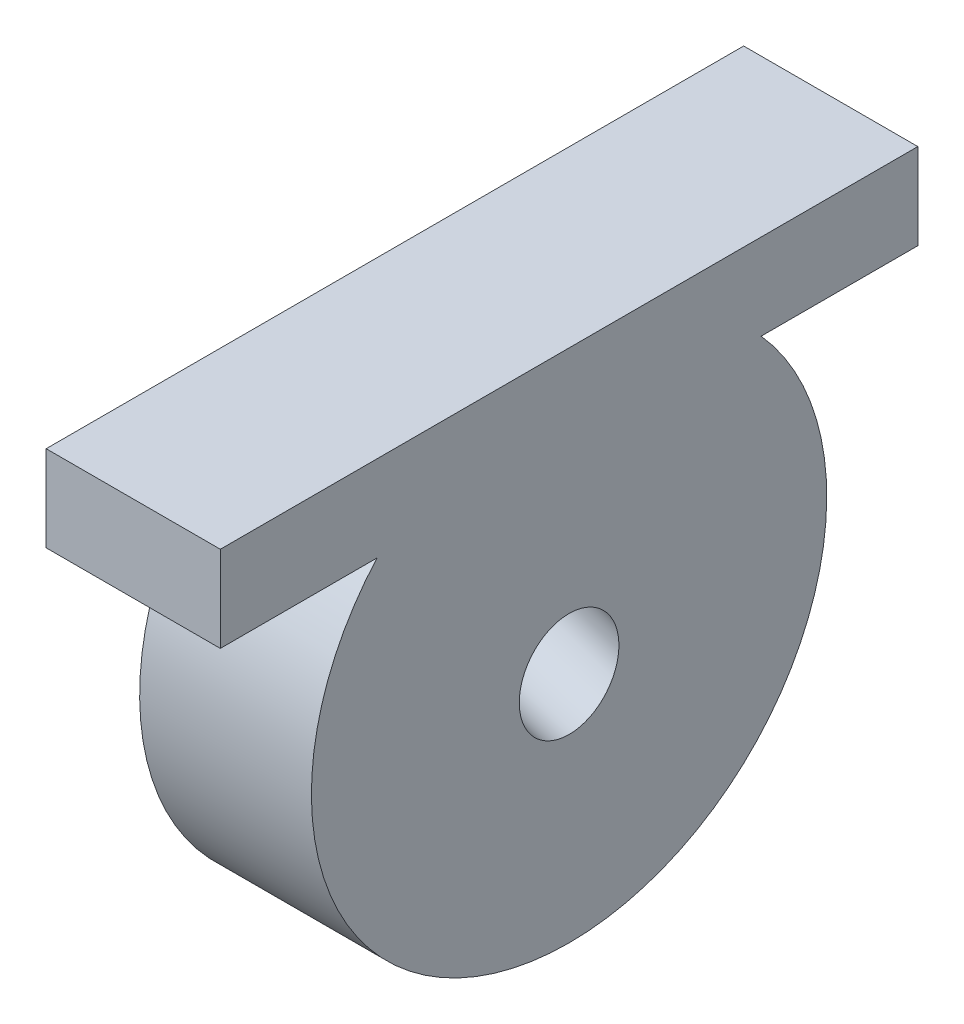
ISO-10303-21;
HEADER;
FILE_DESCRIPTION(('STEP AP214'),'2;1');
FILE_NAME('part.step','',(''),(''),'','','');
FILE_SCHEMA(('AUTOMOTIVE_DESIGN { 1 0 10303 214 1 1 1 1 }'));
ENDSEC;
DATA;
#1=APPLICATION_CONTEXT('core data for automotive mechanical design processes');
#2=APPLICATION_PROTOCOL_DEFINITION('international standard','automotive_design',2000,#1);
#3=PRODUCT_CONTEXT('',#1,'mechanical');
#4=PRODUCT('Part','Part','',(#3));
#5=PRODUCT_RELATED_PRODUCT_CATEGORY('part','',(#4));
#6=PRODUCT_DEFINITION_FORMATION('','',#4);
#7=PRODUCT_DEFINITION_CONTEXT('part definition',#1,'design');
#8=PRODUCT_DEFINITION('design','',#6,#7);
#9=PRODUCT_DEFINITION_SHAPE('','',#8);
#10=(LENGTH_UNIT() NAMED_UNIT(*) SI_UNIT(.MILLI.,.METRE.));
#11=(NAMED_UNIT(*) PLANE_ANGLE_UNIT() SI_UNIT($,.RADIAN.));
#12=(NAMED_UNIT(*) SI_UNIT($,.STERADIAN.) SOLID_ANGLE_UNIT());
#13=UNCERTAINTY_MEASURE_WITH_UNIT(LENGTH_MEASURE(1.E-05),#10,'distance_accuracy_value','');
#14=(GEOMETRIC_REPRESENTATION_CONTEXT(3) GLOBAL_UNCERTAINTY_ASSIGNED_CONTEXT((#13)) GLOBAL_UNIT_ASSIGNED_CONTEXT((#10,
#11,#12)) REPRESENTATION_CONTEXT('',''));
#15=CARTESIAN_POINT('',(0.,0.,0.));
#16=DIRECTION('',(0.,0.,1.));
#17=DIRECTION('',(1.,0.,0.));
#18=AXIS2_PLACEMENT_3D('',#15,#16,#17);
#19=CARTESIAN_POINT('',(524.151448501643,704.936591225601,712.116595063663));
#20=DIRECTION('',(-1.,0.,0.));
#21=DIRECTION('',(0.,0.,1.));
#22=AXIS2_PLACEMENT_3D('',#19,#20,#21);
#23=PLANE('',#22);
#24=CARTESIAN_POINT('',(524.151448501643,675.878895699562,660.547915428341));
#25=DIRECTION('',(-1.,0.,0.));
#26=DIRECTION('',(0.,-1.,0.));
#27=AXIS2_PLACEMENT_3D('',#24,#25,#26);
#28=ELLIPSE('',#27,7.74647110080528,7.36599999999998);
#29=CARTESIAN_POINT('',(524.151448501643,668.132424598756,660.547915428341));
#30=VERTEX_POINT('',#29);
#31=EDGE_CURVE('E124',#30,#30,#28,.T.);
#32=ORIENTED_EDGE('',*,*,#31,.T.);
#33=EDGE_LOOP('',(#32));
#34=FACE_BOUND('',#33,.T.);
#35=DIRECTION('',(0.,0.,1.));
#36=VECTOR('',#35,1.);
#37=CARTESIAN_POINT('',(524.151448501643,717.636591225601,712.116595063663));
#38=LINE('',#37,#36);
#39=CARTESIAN_POINT('',(524.151448501643,717.636591225601,608.979235793011));
#40=VERTEX_POINT('',#39);
#41=CARTESIAN_POINT('',(524.151448501643,717.636591225601,712.116595063663));
#42=VERTEX_POINT('',#41);
#43=EDGE_CURVE('E120',#40,#42,#38,.T.);
#44=ORIENTED_EDGE('',*,*,#43,.T.);
#45=DIRECTION('',(0.,1.,0.));
#46=VECTOR('',#45,1.);
#47=CARTESIAN_POINT('',(524.151448501643,704.936591225601,712.116595063663));
#48=LINE('',#47,#46);
#49=CARTESIAN_POINT('',(524.151448501643,704.936591225601,712.116595063663));
#50=VERTEX_POINT('',#49);
#51=EDGE_CURVE('E14',#50,#42,#48,.T.);
#52=ORIENTED_EDGE('',*,*,#51,.F.);
#53=DIRECTION('',(0.,0.,1.));
#54=VECTOR('',#53,1.);
#55=CARTESIAN_POINT('',(524.151448501643,704.936591225601,712.116595063663));
#56=LINE('',#55,#54);
#57=CARTESIAN_POINT('',(524.151448501643,704.936591225601,688.945978742585));
#58=VERTEX_POINT('',#57);
#59=EDGE_CURVE('E107',#58,#50,#56,.T.);
#60=ORIENTED_EDGE('',*,*,#59,.F.);
#61=CARTESIAN_POINT('',(524.151448501643,679.536591225601,660.547915428337));
#62=DIRECTION('',(1.,0.,0.));
#63=DIRECTION('',(0.,0.,-1.));
#64=AXIS2_PLACEMENT_3D('',#61,#62,#63);
#65=CIRCLE('',#64,38.1000000000001);
#66=CARTESIAN_POINT('',(524.151448501643,704.936591225601,632.14985211409));
#67=VERTEX_POINT('',#66);
#68=EDGE_CURVE('E110',#58,#67,#65,.T.);
#69=ORIENTED_EDGE('',*,*,#68,.T.);
#70=CARTESIAN_POINT('',(524.151448501643,704.936591225601,608.979235793011));
#71=VERTEX_POINT('',#70);
#72=EDGE_CURVE('E112',#71,#67,#56,.T.);
#73=ORIENTED_EDGE('',*,*,#72,.F.);
#74=DIRECTION('',(0.,1.,0.));
#75=VECTOR('',#74,1.);
#76=CARTESIAN_POINT('',(524.151448501643,704.936591225601,608.979235793011));
#77=LINE('',#76,#75);
#78=EDGE_CURVE('E138',#71,#40,#77,.T.);
#79=ORIENTED_EDGE('',*,*,#78,.T.);
#80=EDGE_LOOP('',(#44,#52,#60,#69,#73,#79));
#81=FACE_BOUND('',#80,.T.);
#82=ADVANCED_FACE('F55',(#34,#81),#23,.F.);
#83=CARTESIAN_POINT('',(524.151448501643,704.936591225601,712.116595063663));
#84=DIRECTION('',(0.,0.,-1.));
#85=DIRECTION('',(0.,1.,0.));
#86=AXIS2_PLACEMENT_3D('',#83,#84,#85);
#87=PLANE('',#86);
#88=DIRECTION('',(-1.,0.,0.));
#89=VECTOR('',#88,1.);
#90=CARTESIAN_POINT('',(524.151448501643,717.636591225601,712.116595063663));
#91=LINE('',#90,#89);
#92=CARTESIAN_POINT('',(498.398398097908,717.636591225601,712.116595063663));
#93=VERTEX_POINT('',#92);
#94=EDGE_CURVE('E140',#42,#93,#91,.T.);
#95=ORIENTED_EDGE('',*,*,#94,.T.);
#96=DIRECTION('',(0.,1.,0.));
#97=VECTOR('',#96,1.);
#98=CARTESIAN_POINT('',(498.398398097908,704.936591225601,712.116595063663));
#99=LINE('',#98,#97);
#100=CARTESIAN_POINT('',(498.398398097908,704.936591225601,712.116595063663));
#101=VERTEX_POINT('',#100);
#102=EDGE_CURVE('E63',#101,#93,#99,.T.);
#103=ORIENTED_EDGE('',*,*,#102,.F.);
#104=DIRECTION('',(-1.,0.,0.));
#105=VECTOR('',#104,1.);
#106=CARTESIAN_POINT('',(524.151448501643,704.936591225601,712.116595063663));
#107=LINE('',#106,#105);
#108=EDGE_CURVE('E132',#50,#101,#107,.T.);
#109=ORIENTED_EDGE('',*,*,#108,.F.);
#110=ORIENTED_EDGE('',*,*,#51,.T.);
#111=EDGE_LOOP('',(#95,#103,#109,#110));
#112=FACE_BOUND('',#111,.T.);
#113=ADVANCED_FACE('F167',(#112),#87,.F.);
#114=CARTESIAN_POINT('',(498.398398097908,704.936591225601,712.116595063663));
#115=DIRECTION('',(1.,0.,0.));
#116=DIRECTION('',(0.,0.,-1.));
#117=AXIS2_PLACEMENT_3D('',#114,#115,#116);
#118=PLANE('',#117);
#119=DIRECTION('',(0.,0.,-1.));
#120=VECTOR('',#119,1.);
#121=CARTESIAN_POINT('',(498.398398097908,717.636591225601,712.116595063663));
#122=LINE('',#121,#120);
#123=CARTESIAN_POINT('',(498.398398097908,717.636591225601,608.979235793011));
#124=VERTEX_POINT('',#123);
#125=EDGE_CURVE('E142',#93,#124,#122,.T.);
#126=ORIENTED_EDGE('',*,*,#125,.T.);
#127=DIRECTION('',(0.,1.,0.));
#128=VECTOR('',#127,1.);
#129=CARTESIAN_POINT('',(498.398398097908,704.936591225601,608.979235793011));
#130=LINE('',#129,#128);
#131=CARTESIAN_POINT('',(498.398398097908,704.936591225601,608.979235793011));
#132=VERTEX_POINT('',#131);
#133=EDGE_CURVE('E147',#132,#124,#130,.T.);
#134=ORIENTED_EDGE('',*,*,#133,.F.);
#135=DIRECTION('',(0.,0.,-1.));
#136=VECTOR('',#135,1.);
#137=CARTESIAN_POINT('',(498.398398097908,704.936591225601,712.116595063663));
#138=LINE('',#137,#136);
#139=EDGE_CURVE('E134',#101,#132,#138,.T.);
#140=ORIENTED_EDGE('',*,*,#139,.F.);
#141=ORIENTED_EDGE('',*,*,#102,.T.);
#142=EDGE_LOOP('',(#126,#134,#140,#141));
#143=FACE_BOUND('',#142,.T.);
#144=ADVANCED_FACE('F155',(#143),#118,.F.);
#145=CARTESIAN_POINT('',(524.151448501643,704.936591225601,608.979235793011));
#146=DIRECTION('',(0.,0.,1.));
#147=DIRECTION('',(0.,-1.,0.));
#148=AXIS2_PLACEMENT_3D('',#145,#146,#147);
#149=PLANE('',#148);
#150=DIRECTION('',(1.,0.,0.));
#151=VECTOR('',#150,1.);
#152=CARTESIAN_POINT('',(524.151448501643,717.636591225601,608.979235793011));
#153=LINE('',#152,#151);
#154=EDGE_CURVE('E113',#124,#40,#153,.T.);
#155=ORIENTED_EDGE('',*,*,#154,.T.);
#156=ORIENTED_EDGE('',*,*,#78,.F.);
#157=DIRECTION('',(1.,0.,0.));
#158=VECTOR('',#157,1.);
#159=CARTESIAN_POINT('',(524.151448501643,704.936591225601,608.979235793011));
#160=LINE('',#159,#158);
#161=EDGE_CURVE('E136',#132,#71,#160,.T.);
#162=ORIENTED_EDGE('',*,*,#161,.F.);
#163=ORIENTED_EDGE('',*,*,#133,.T.);
#164=EDGE_LOOP('',(#155,#156,#162,#163));
#165=FACE_BOUND('',#164,.T.);
#166=ADVANCED_FACE('F165',(#165),#149,.F.);
#167=CARTESIAN_POINT('',(-2.22044604925031E-13,704.936591225599,2.66453525910038E-12));
#168=DIRECTION('',(0.,1.,0.));
#169=DIRECTION('',(0.,0.,1.));
#170=AXIS2_PLACEMENT_3D('',#167,#168,#169);
#171=PLANE('',#170);
#172=DIRECTION('',(0.,0.,-1.));
#173=VECTOR('',#172,1.);
#174=CARTESIAN_POINT('',(498.751448501643,704.936591225599,-1.33226762955019E-12));
#175=LINE('',#174,#173);
#176=CARTESIAN_POINT('',(498.751448501643,704.936591225601,688.945978742585));
#177=VERTEX_POINT('',#176);
#178=CARTESIAN_POINT('',(498.751448501643,704.936591225601,632.14985211409));
#179=VERTEX_POINT('',#178);
#180=EDGE_CURVE('E74',#177,#179,#175,.T.);
#181=ORIENTED_EDGE('',*,*,#180,.F.);
#182=DIRECTION('',(1.,0.,0.));
#183=VECTOR('',#182,1.);
#184=CARTESIAN_POINT('',(498.751448501643,704.936591225601,688.945978742585));
#185=LINE('',#184,#183);
#186=EDGE_CURVE('E115',#177,#58,#185,.T.);
#187=ORIENTED_EDGE('',*,*,#186,.T.);
#188=ORIENTED_EDGE('',*,*,#59,.T.);
#189=ORIENTED_EDGE('',*,*,#108,.T.);
#190=ORIENTED_EDGE('',*,*,#139,.T.);
#191=ORIENTED_EDGE('',*,*,#161,.T.);
#192=ORIENTED_EDGE('',*,*,#72,.T.);
#193=DIRECTION('',(1.,0.,0.));
#194=VECTOR('',#193,1.);
#195=CARTESIAN_POINT('',(498.751448501643,704.936591225601,632.14985211409));
#196=LINE('',#195,#194);
#197=EDGE_CURVE('E70',#67,#179,#196,.F.);
#198=ORIENTED_EDGE('',*,*,#197,.T.);
#199=EDGE_LOOP('',(#181,#187,#188,#189,#190,#191,#192,#198));
#200=FACE_BOUND('',#199,.T.);
#201=ADVANCED_FACE('F116',(#200),#171,.F.);
#202=CARTESIAN_POINT('',(-2.22044604925031E-13,717.636591225599,2.66453525910038E-12));
#203=DIRECTION('',(0.,1.,0.));
#204=DIRECTION('',(0.,0.,1.));
#205=AXIS2_PLACEMENT_3D('',#202,#203,#204);
#206=PLANE('',#205);
#207=ORIENTED_EDGE('',*,*,#94,.F.);
#208=ORIENTED_EDGE('',*,*,#43,.F.);
#209=ORIENTED_EDGE('',*,*,#154,.F.);
#210=ORIENTED_EDGE('',*,*,#125,.F.);
#211=EDGE_LOOP('',(#207,#208,#209,#210));
#212=FACE_BOUND('',#211,.T.);
#213=ADVANCED_FACE('F161',(#212),#206,.T.);
#214=CARTESIAN_POINT('',(498.751448501643,679.536591225601,660.547915428337));
#215=DIRECTION('',(1.,0.,0.));
#216=DIRECTION('',(0.,0.,-1.));
#217=AXIS2_PLACEMENT_3D('',#214,#215,#216);
#218=CYLINDRICAL_SURFACE('',#217,38.1000000000001);
#219=ORIENTED_EDGE('',*,*,#186,.F.);
#220=CARTESIAN_POINT('',(498.751448501643,679.536591225601,660.547915428337));
#221=DIRECTION('',(1.,0.,0.));
#222=DIRECTION('',(0.,0.,-1.));
#223=AXIS2_PLACEMENT_3D('',#220,#221,#222);
#224=CIRCLE('',#223,38.1000000000001);
#225=EDGE_CURVE('E123',#177,#179,#224,.T.);
#226=ORIENTED_EDGE('',*,*,#225,.T.);
#227=ORIENTED_EDGE('',*,*,#197,.F.);
#228=ORIENTED_EDGE('',*,*,#68,.F.);
#229=EDGE_LOOP('',(#219,#226,#227,#228));
#230=FACE_BOUND('',#229,.T.);
#231=ADVANCED_FACE('F122',(#230),#218,.T.);
#232=CARTESIAN_POINT('',(498.751448501643,679.536591225601,660.547915428337));
#233=DIRECTION('',(1.,0.,0.));
#234=DIRECTION('',(0.,0.,-1.));
#235=AXIS2_PLACEMENT_3D('',#232,#233,#234);
#236=PLANE('',#235);
#237=CARTESIAN_POINT('',(498.751448501643,684.147469009701,660.547915428336));
#238=DIRECTION('',(1.,0.,0.));
#239=DIRECTION('',(0.,-1.,0.));
#240=AXIS2_PLACEMENT_3D('',#237,#238,#239);
#241=ELLIPSE('',#240,7.74647110080528,7.36599999999998);
#242=CARTESIAN_POINT('',(498.751448501643,676.400997908896,660.547915428336));
#243=VERTEX_POINT('',#242);
#244=EDGE_CURVE('E58',#243,#243,#241,.T.);
#245=ORIENTED_EDGE('',*,*,#244,.T.);
#246=EDGE_LOOP('',(#245));
#247=FACE_BOUND('',#246,.T.);
#248=ORIENTED_EDGE('',*,*,#225,.F.);
#249=ORIENTED_EDGE('',*,*,#180,.T.);
#250=EDGE_LOOP('',(#248,#249));
#251=FACE_BOUND('',#250,.T.);
#252=ADVANCED_FACE('F184',(#247,#251),#236,.F.);
#253=CARTESIAN_POINT('',(472.450490510458,692.70933512297,660.547915428339));
#254=DIRECTION('',(0.95088459043425,-0.309545627775113,0.));
#255=DIRECTION('',(0.309545627775113,0.95088459043425,0.));
#256=AXIS2_PLACEMENT_3D('',#253,#254,#255);
#257=CYLINDRICAL_SURFACE('',#256,7.36599999999998);
#258=ORIENTED_EDGE('',*,*,#244,.F.);
#259=EDGE_LOOP('',(#258));
#260=FACE_BOUND('',#259,.T.);
#261=ORIENTED_EDGE('',*,*,#31,.F.);
#262=EDGE_LOOP('',(#261));
#263=FACE_BOUND('',#262,.T.);
#264=ADVANCED_FACE('F187',(#260,#263),#257,.F.);
#265=CLOSED_SHELL('',(#82,#113,#144,#166,#201,#213,#231,#252,#264));
#266=MANIFOLD_SOLID_BREP('B2',#265);
#267=ADVANCED_BREP_SHAPE_REPRESENTATION('',(#18,#266),#14);
#268=SHAPE_DEFINITION_REPRESENTATION(#9,#267);
ENDSEC;
END-ISO-10303-21;
